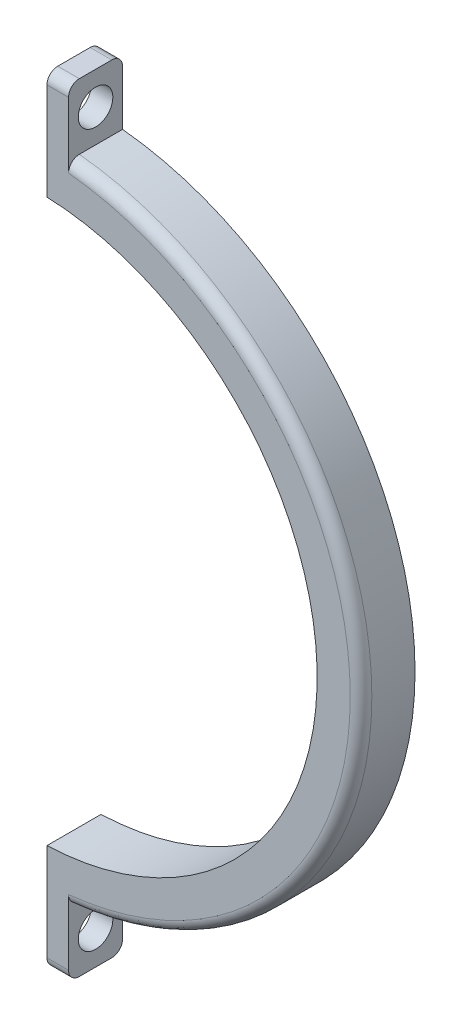
ISO-10303-21;
HEADER;
FILE_DESCRIPTION(('STEP AP214'),'2;1');
FILE_NAME('part.step','',(''),(''),'','','');
FILE_SCHEMA(('AUTOMOTIVE_DESIGN { 1 0 10303 214 1 1 1 1 }'));
ENDSEC;
DATA;
#1=APPLICATION_CONTEXT('core data for automotive mechanical design processes');
#2=APPLICATION_PROTOCOL_DEFINITION('international standard','automotive_design',2000,#1);
#3=PRODUCT_CONTEXT('',#1,'mechanical');
#4=PRODUCT('Part','Part','',(#3));
#5=PRODUCT_RELATED_PRODUCT_CATEGORY('part','',(#4));
#6=PRODUCT_DEFINITION_FORMATION('','',#4);
#7=PRODUCT_DEFINITION_CONTEXT('part definition',#1,'design');
#8=PRODUCT_DEFINITION('design','',#6,#7);
#9=PRODUCT_DEFINITION_SHAPE('','',#8);
#10=(LENGTH_UNIT() NAMED_UNIT(*) SI_UNIT(.MILLI.,.METRE.));
#11=(NAMED_UNIT(*) PLANE_ANGLE_UNIT() SI_UNIT($,.RADIAN.));
#12=(NAMED_UNIT(*) SI_UNIT($,.STERADIAN.) SOLID_ANGLE_UNIT());
#13=UNCERTAINTY_MEASURE_WITH_UNIT(LENGTH_MEASURE(1.E-05),#10,'distance_accuracy_value','');
#14=(GEOMETRIC_REPRESENTATION_CONTEXT(3) GLOBAL_UNCERTAINTY_ASSIGNED_CONTEXT((#13)) GLOBAL_UNIT_ASSIGNED_CONTEXT((#10,
#11,#12)) REPRESENTATION_CONTEXT('',''));
#15=CARTESIAN_POINT('',(0.,0.,0.));
#16=DIRECTION('',(0.,0.,1.));
#17=DIRECTION('',(1.,0.,0.));
#18=AXIS2_PLACEMENT_3D('',#15,#16,#17);
#19=CARTESIAN_POINT('',(0.,36.,1.));
#20=DIRECTION('',(0.,1.,0.));
#21=DIRECTION('',(0.,0.,1.));
#22=AXIS2_PLACEMENT_3D('',#19,#20,#21);
#23=PLANE('',#22);
#24=DIRECTION('',(0.,0.,1.));
#25=VECTOR('',#24,1.);
#26=CARTESIAN_POINT('',(2.,36.,2.5));
#27=LINE('',#26,#25);
#28=CARTESIAN_POINT('',(2.,36.,1.));
#29=VERTEX_POINT('',#28);
#30=CARTESIAN_POINT('',(2.,36.,4.));
#31=VERTEX_POINT('',#30);
#32=EDGE_CURVE('E173',#29,#31,#27,.T.);
#33=ORIENTED_EDGE('',*,*,#32,.F.);
#34=DIRECTION('',(-1.,0.,0.));
#35=VECTOR('',#34,1.);
#36=CARTESIAN_POINT('',(0.,36.,1.));
#37=LINE('',#36,#35);
#38=CARTESIAN_POINT('',(0.,36.,1.));
#39=VERTEX_POINT('',#38);
#40=EDGE_CURVE('E249',#39,#29,#37,.F.);
#41=ORIENTED_EDGE('',*,*,#40,.F.);
#42=DIRECTION('',(0.,0.,-1.));
#43=VECTOR('',#42,1.);
#44=CARTESIAN_POINT('',(0.,36.,2.5));
#45=LINE('',#44,#43);
#46=CARTESIAN_POINT('',(0.,36.,4.));
#47=VERTEX_POINT('',#46);
#48=EDGE_CURVE('E164',#47,#39,#45,.T.);
#49=ORIENTED_EDGE('',*,*,#48,.F.);
#50=DIRECTION('',(1.,0.,0.));
#51=VECTOR('',#50,1.);
#52=CARTESIAN_POINT('',(0.,36.,4.));
#53=LINE('',#52,#51);
#54=EDGE_CURVE('E247',#31,#47,#53,.F.);
#55=ORIENTED_EDGE('',*,*,#54,.F.);
#56=EDGE_LOOP('',(#33,#41,#49,#55));
#57=FACE_BOUND('',#56,.T.);
#58=ADVANCED_FACE('F16',(#57),#23,.T.);
#59=CARTESIAN_POINT('',(0.,32.9666295470958,2.5));
#60=DIRECTION('',(1.,0.,0.));
#61=DIRECTION('',(0.,0.,-1.));
#62=AXIS2_PLACEMENT_3D('',#59,#60,#61);
#63=CYLINDRICAL_SURFACE('',#62,1.6);
#64=CARTESIAN_POINT('',(2.,32.9666295470958,2.5));
#65=DIRECTION('',(1.,0.,0.));
#66=DIRECTION('',(0.,0.,-1.));
#67=AXIS2_PLACEMENT_3D('',#64,#65,#66);
#68=CIRCLE('',#67,1.6);
#69=CARTESIAN_POINT('',(2.,32.9666295470958,0.9));
#70=VERTEX_POINT('',#69);
#71=EDGE_CURVE('E251',#70,#70,#68,.F.);
#72=ORIENTED_EDGE('',*,*,#71,.F.);
#73=EDGE_LOOP('',(#72));
#74=FACE_BOUND('',#73,.T.);
#75=CARTESIAN_POINT('',(0.,32.9666295470958,2.5));
#76=DIRECTION('',(1.,0.,0.));
#77=DIRECTION('',(0.,0.,-1.));
#78=AXIS2_PLACEMENT_3D('',#75,#76,#77);
#79=CIRCLE('',#78,1.6);
#80=CARTESIAN_POINT('',(0.,32.9666295470958,0.9));
#81=VERTEX_POINT('',#80);
#82=EDGE_CURVE('E163',#81,#81,#79,.T.);
#83=ORIENTED_EDGE('',*,*,#82,.F.);
#84=EDGE_LOOP('',(#83));
#85=FACE_BOUND('',#84,.T.);
#86=ADVANCED_FACE('F365',(#74,#85),#63,.F.);
#87=CARTESIAN_POINT('',(0.,35.,4.));
#88=DIRECTION('',(1.,0.,0.));
#89=DIRECTION('',(0.,0.,-1.));
#90=AXIS2_PLACEMENT_3D('',#87,#88,#89);
#91=CYLINDRICAL_SURFACE('',#90,1.);
#92=CARTESIAN_POINT('',(2.,35.,4.));
#93=DIRECTION('',(1.,0.,0.));
#94=DIRECTION('',(0.,0.,-1.));
#95=AXIS2_PLACEMENT_3D('',#92,#93,#94);
#96=CIRCLE('',#95,1.);
#97=CARTESIAN_POINT('',(2.,35.,5.));
#98=VERTEX_POINT('',#97);
#99=EDGE_CURVE('E85',#31,#98,#96,.T.);
#100=ORIENTED_EDGE('',*,*,#99,.F.);
#101=ORIENTED_EDGE('',*,*,#54,.T.);
#102=CARTESIAN_POINT('',(0.,35.,4.));
#103=DIRECTION('',(1.,0.,0.));
#104=DIRECTION('',(0.,0.,-1.));
#105=AXIS2_PLACEMENT_3D('',#102,#103,#104);
#106=CIRCLE('',#105,1.);
#107=CARTESIAN_POINT('',(0.,35.,5.));
#108=VERTEX_POINT('',#107);
#109=EDGE_CURVE('E167',#108,#47,#106,.F.);
#110=ORIENTED_EDGE('',*,*,#109,.F.);
#111=DIRECTION('',(-1.,0.,0.));
#112=VECTOR('',#111,1.);
#113=CARTESIAN_POINT('',(13.0430860613657,35.,5.));
#114=LINE('',#113,#112);
#115=EDGE_CURVE('E252',#98,#108,#114,.T.);
#116=ORIENTED_EDGE('',*,*,#115,.F.);
#117=EDGE_LOOP('',(#100,#101,#110,#116));
#118=FACE_BOUND('',#117,.T.);
#119=ADVANCED_FACE('F361',(#118),#91,.T.);
#120=CARTESIAN_POINT('',(29.0832179129826,0.,4.));
#121=CARTESIAN_POINT('',(29.0832179129826,0.,6.));
#122=CARTESIAN_POINT('',(27.0832179129826,0.,6.));
#123=CARTESIAN_POINT('',(27.0832179129826,0.,4.));
#124=(BOUNDED_CURVE() B_SPLINE_CURVE(3,(#120,#121,#122,#123),.UNSPECIFIED.,.F.,
.F.) B_SPLINE_CURVE_WITH_KNOTS((4,4),(0.,0.5),
.UNSPECIFIED.) CURVE() GEOMETRIC_REPRESENTATION_ITEM() RATIONAL_B_SPLINE_CURVE((1.,
0.333333333333333,0.333333333333333,1.)) REPRESENTATION_ITEM(''));
#125=CARTESIAN_POINT('',(-0.999999999999999,0.,4.));
#126=DIRECTION('',(0.,0.,1.));
#127=AXIS1_PLACEMENT('',#125,#126);
#128=SURFACE_OF_REVOLUTION('',#124,#127);
#129=CARTESIAN_POINT('',(-0.999999999999999,0.,5.));
#130=DIRECTION('',(0.,0.,-1.));
#131=DIRECTION('',(1.,0.,0.));
#132=AXIS2_PLACEMENT_3D('',#129,#130,#131);
#133=CIRCLE('',#132,29.0832179129826);
#134=CARTESIAN_POINT('',(2.,-28.9280757081081,5.));
#135=VERTEX_POINT('',#134);
#136=CARTESIAN_POINT('',(28.0832179129826,0.,5.));
#137=VERTEX_POINT('',#136);
#138=EDGE_CURVE('E246',#135,#137,#133,.F.);
#139=ORIENTED_EDGE('',*,*,#138,.F.);
#140=CARTESIAN_POINT('',(1.99999999999998,-29.9332590941915,4.));
#141=CARTESIAN_POINT('',(1.99999999999999,-29.9332589661824,4.02803183269185));
#142=CARTESIAN_POINT('',(2.,-29.9320737585184,4.05605019102894));
#143=CARTESIAN_POINT('',(2.,-29.9273459549339,4.11188568328244));
#144=CARTESIAN_POINT('',(2.,-29.9238034920647,4.13970282846642));
#145=CARTESIAN_POINT('',(2.,-29.9096760263512,4.22249705120212));
#146=CARTESIAN_POINT('',(2.00000000000001,-29.8955908401553,4.27691834244368));
#147=CARTESIAN_POINT('',(2.00000000000001,-29.8584889872002,4.38262006080036));
#148=CARTESIAN_POINT('',(2.,-29.8354684541231,4.43389911713611));
#149=CARTESIAN_POINT('',(2.,-29.7811632216144,4.53187677663943));
#150=CARTESIAN_POINT('',(2.00000000000001,-29.7498796560895,4.5785760070754));
#151=CARTESIAN_POINT('',(2.00000000000001,-29.6798778782342,4.66618158315184));
#152=CARTESIAN_POINT('',(2.00000000000001,-29.6411432079633,4.70707475025362));
#153=CARTESIAN_POINT('',(1.99999999999999,-29.5573609954424,4.78182812502759));
#154=CARTESIAN_POINT('',(1.99999999999998,-29.5123132914432,4.81568815244545));
#155=CARTESIAN_POINT('',(1.99999999999999,-29.440903741359,4.86055283906325));
#156=CARTESIAN_POINT('',(2.,-29.4163776491829,4.87455477331068));
#157=CARTESIAN_POINT('',(2.,-29.3662620346612,4.90044115369128));
#158=CARTESIAN_POINT('',(2.,-29.3406734824559,4.91232748134967));
#159=CARTESIAN_POINT('',(2.,-29.2625470750562,4.94469431836769));
#160=CARTESIAN_POINT('',(2.,-29.2086027360664,4.96191134786867));
#161=CARTESIAN_POINT('',(2.00000000000001,-29.1166528432015,4.98297816706326));
#162=CARTESIAN_POINT('',(2.,-29.0791972040401,4.98935735370594));
#163=CARTESIAN_POINT('',(2.,-29.003860288784,4.99786667802282));
#164=CARTESIAN_POINT('',(1.99999999999999,-28.9659796937183,5.00000284522244));
#165=CARTESIAN_POINT('',(1.99999999999999,-28.9280757081081,5.));
#166=B_SPLINE_CURVE_WITH_KNOTS('',3,(#140,#141,#142,#143,#144,#145,#146,#147,#148,#149,#150,
#151,#152,#153,#154,#155,#156,#157,#158,#159,#160,#161,#162,#163,#164,#165),.UNSPECIFIED.,.F.,
.F.,(4,2,2,2,2,2,2,2,2,2,2,2,4),(0.,0.0840437049258011,0.168082666546933,0.335860191526751,
0.503710394794133,0.671537576530788,0.839739800789691,1.00794633541942,1.09258364804093,
1.17714530777996,1.34610868702409,1.45987627565296,1.57348207932152),.UNSPECIFIED.);
#167=CARTESIAN_POINT('',(1.99999999999999,-29.9332590941915,4.));
#168=VERTEX_POINT('',#167);
#169=EDGE_CURVE('E175',#168,#135,#166,.T.);
#170=ORIENTED_EDGE('',*,*,#169,.F.);
#171=CARTESIAN_POINT('',(-0.999999999999997,0.,4.));
#172=DIRECTION('',(0.,0.,-1.));
#173=DIRECTION('',(-1.,0.,0.));
#174=AXIS2_PLACEMENT_3D('',#171,#172,#173);
#175=CIRCLE('',#174,30.0832179129826);
#176=CARTESIAN_POINT('',(2.,29.9332590941915,4.));
#177=VERTEX_POINT('',#176);
#178=EDGE_CURVE('E179',#177,#168,#175,.T.);
#179=ORIENTED_EDGE('',*,*,#178,.F.);
#180=CARTESIAN_POINT('',(2.,28.9280757081081,5.));
#181=CARTESIAN_POINT('',(2.,28.9564654745857,4.99999971763141));
#182=CARTESIAN_POINT('',(2.,28.9848416839974,4.9988031447003));
#183=CARTESIAN_POINT('',(2.,29.0413920253424,4.99402874132168));
#184=CARTESIAN_POINT('',(2.,29.0695661642327,4.99045099325509));
#185=CARTESIAN_POINT('',(2.,29.153442395582,4.97617707386501));
#186=CARTESIAN_POINT('',(1.99999999999999,29.2085841485179,4.96194014852983));
#187=CARTESIAN_POINT('',(1.99999999999999,29.3156951400941,4.92440587265042));
#188=CARTESIAN_POINT('',(2.,29.36766264905,4.9011036323761));
#189=CARTESIAN_POINT('',(2.,29.4669318603245,4.84608498402124));
#190=CARTESIAN_POINT('',(2.,29.5142345987746,4.81437045026687));
#191=CARTESIAN_POINT('',(2.,29.6026991589646,4.74350778100956));
#192=CARTESIAN_POINT('',(2.,29.6438755337486,4.70437778083796));
#193=CARTESIAN_POINT('',(2.,29.7190462831808,4.61970438955179));
#194=CARTESIAN_POINT('',(2.,29.7530410836587,4.57416137896219));
#195=CARTESIAN_POINT('',(2.,29.79780393353,4.50217955309637));
#196=CARTESIAN_POINT('',(2.,29.8116689926746,4.47761766634511));
#197=CARTESIAN_POINT('',(2.,29.8372629704534,4.42743451754058));
#198=CARTESIAN_POINT('',(2.,29.8489937695365,4.40181421270226));
#199=CARTESIAN_POINT('',(2.,29.8808549904111,4.32360665407879));
#200=CARTESIAN_POINT('',(1.99999999999998,29.8976876812935,4.26961888918407));
#201=CARTESIAN_POINT('',(1.99999999999998,29.9176210279945,4.17940388514848));
#202=CARTESIAN_POINT('',(1.99999999999999,29.9234815411749,4.14375189024134));
#203=CARTESIAN_POINT('',(2.00000000000001,29.9312988208954,4.07207399805051));
#204=CARTESIAN_POINT('',(2.00000000000001,29.933261148039,4.03604870715611));
#205=CARTESIAN_POINT('',(2.,29.9332590941915,4.));
#206=B_SPLINE_CURVE_WITH_KNOTS('',3,(#180,#181,#182,#183,#184,#185,#186,#187,#188,#189,#190,
#191,#192,#193,#194,#195,#196,#197,#198,#199,#200,#201,#202,#203,#204,#205),.UNSPECIFIED.,.F.,
.F.,(4,2,2,2,2,2,2,2,2,2,2,2,4),(0.,0.0851171284531173,0.170231312283935,0.340205411605452,
0.510271320467366,0.680299369069249,0.849916839896694,1.01952425047132,1.10405113039033,
1.18850317103927,1.35721939918158,1.46542056154832,1.57346726821852),.UNSPECIFIED.);
#207=CARTESIAN_POINT('',(1.99999999999999,28.9280757081081,5.));
#208=VERTEX_POINT('',#207);
#209=EDGE_CURVE('E279',#208,#177,#206,.T.);
#210=ORIENTED_EDGE('',*,*,#209,.F.);
#211=CARTESIAN_POINT('',(-0.999999999999999,0.,5.));
#212=DIRECTION('',(0.,0.,-1.));
#213=DIRECTION('',(0.103152271835119,0.994665576369894,0.));
#214=AXIS2_PLACEMENT_3D('',#211,#212,#213);
#215=CIRCLE('',#214,29.0832179129826);
#216=EDGE_CURVE('E93',#137,#208,#215,.F.);
#217=ORIENTED_EDGE('',*,*,#216,.F.);
#218=EDGE_LOOP('',(#139,#170,#179,#210,#217));
#219=FACE_BOUND('',#218,.T.);
#220=ADVANCED_FACE('F18',(#219),#128,.T.);
#221=CARTESIAN_POINT('',(2.,28.9280757081081,5.));
#222=DIRECTION('',(1.,0.,0.));
#223=DIRECTION('',(0.,0.,-1.));
#224=AXIS2_PLACEMENT_3D('',#221,#222,#223);
#225=PLANE('',#224);
#226=ORIENTED_EDGE('',*,*,#71,.T.);
#227=EDGE_LOOP('',(#226));
#228=FACE_BOUND('',#227,.T.);
#229=DIRECTION('',(0.,1.,0.));
#230=VECTOR('',#229,1.);
#231=CARTESIAN_POINT('',(2.,0.,0.));
#232=LINE('',#231,#230);
#233=CARTESIAN_POINT('',(2.,29.9332590941915,0.));
#234=VERTEX_POINT('',#233);
#235=CARTESIAN_POINT('',(2.,35.,0.));
#236=VERTEX_POINT('',#235);
#237=EDGE_CURVE('E172',#234,#236,#232,.T.);
#238=ORIENTED_EDGE('',*,*,#237,.T.);
#239=CARTESIAN_POINT('',(2.,35.,1.));
#240=DIRECTION('',(-1.,0.,0.));
#241=DIRECTION('',(0.,0.,1.));
#242=AXIS2_PLACEMENT_3D('',#239,#240,#241);
#243=CIRCLE('',#242,1.);
#244=EDGE_CURVE('E250',#29,#236,#243,.T.);
#245=ORIENTED_EDGE('',*,*,#244,.F.);
#246=ORIENTED_EDGE('',*,*,#32,.T.);
#247=ORIENTED_EDGE('',*,*,#99,.T.);
#248=DIRECTION('',(0.,1.,0.));
#249=VECTOR('',#248,1.);
#250=CARTESIAN_POINT('',(2.,0.,5.));
#251=LINE('',#250,#249);
#252=EDGE_CURVE('E254',#208,#98,#251,.T.);
#253=ORIENTED_EDGE('',*,*,#252,.F.);
#254=ORIENTED_EDGE('',*,*,#209,.T.);
#255=DIRECTION('',(0.,0.,-1.));
#256=VECTOR('',#255,1.);
#257=CARTESIAN_POINT('',(2.,29.9332590941915,5.));
#258=LINE('',#257,#256);
#259=EDGE_CURVE('E176',#234,#177,#258,.F.);
#260=ORIENTED_EDGE('',*,*,#259,.F.);
#261=EDGE_LOOP('',(#238,#245,#246,#247,#253,#254,#260));
#262=FACE_BOUND('',#261,.T.);
#263=ADVANCED_FACE('F288',(#228,#262),#225,.T.);
#264=CARTESIAN_POINT('',(2.,35.,1.));
#265=DIRECTION('',(-1.,0.,0.));
#266=DIRECTION('',(0.,0.,1.));
#267=AXIS2_PLACEMENT_3D('',#264,#265,#266);
#268=CYLINDRICAL_SURFACE('',#267,1.);
#269=ORIENTED_EDGE('',*,*,#244,.T.);
#270=DIRECTION('',(-1.,0.,0.));
#271=VECTOR('',#270,1.);
#272=CARTESIAN_POINT('',(13.9964638012394,35.,0.));
#273=LINE('',#272,#271);
#274=CARTESIAN_POINT('',(0.,35.,0.));
#275=VERTEX_POINT('',#274);
#276=EDGE_CURVE('E168',#236,#275,#273,.T.);
#277=ORIENTED_EDGE('',*,*,#276,.T.);
#278=CARTESIAN_POINT('',(0.,35.,1.));
#279=DIRECTION('',(-1.,0.,0.));
#280=DIRECTION('',(0.,0.,1.));
#281=AXIS2_PLACEMENT_3D('',#278,#279,#280);
#282=CIRCLE('',#281,1.);
#283=EDGE_CURVE('E166',#39,#275,#282,.T.);
#284=ORIENTED_EDGE('',*,*,#283,.F.);
#285=ORIENTED_EDGE('',*,*,#40,.T.);
#286=EDGE_LOOP('',(#269,#277,#284,#285));
#287=FACE_BOUND('',#286,.T.);
#288=ADVANCED_FACE('F196',(#287),#268,.T.);
#289=CARTESIAN_POINT('',(0.,36.,0.));
#290=DIRECTION('',(-1.,0.,0.));
#291=DIRECTION('',(0.,-1.,0.));
#292=AXIS2_PLACEMENT_3D('',#289,#290,#291);
#293=PLANE('',#292);
#294=ORIENTED_EDGE('',*,*,#82,.T.);
#295=EDGE_LOOP('',(#294));
#296=FACE_BOUND('',#295,.T.);
#297=DIRECTION('',(0.,-1.,0.));
#298=VECTOR('',#297,1.);
#299=CARTESIAN_POINT('',(0.,0.,0.));
#300=LINE('',#299,#298);
#301=CARTESIAN_POINT('',(0.,26.,0.));
#302=VERTEX_POINT('',#301);
#303=EDGE_CURVE('E171',#275,#302,#300,.T.);
#304=ORIENTED_EDGE('',*,*,#303,.T.);
#305=DIRECTION('',(0.,0.,-1.));
#306=VECTOR('',#305,1.);
#307=CARTESIAN_POINT('',(0.,26.,5.));
#308=LINE('',#307,#306);
#309=CARTESIAN_POINT('',(0.,26.,5.));
#310=VERTEX_POINT('',#309);
#311=EDGE_CURVE('E159',#302,#310,#308,.F.);
#312=ORIENTED_EDGE('',*,*,#311,.T.);
#313=DIRECTION('',(0.,-1.,0.));
#314=VECTOR('',#313,1.);
#315=CARTESIAN_POINT('',(0.,0.,5.));
#316=LINE('',#315,#314);
#317=EDGE_CURVE('E253',#108,#310,#316,.T.);
#318=ORIENTED_EDGE('',*,*,#317,.F.);
#319=ORIENTED_EDGE('',*,*,#109,.T.);
#320=ORIENTED_EDGE('',*,*,#48,.T.);
#321=ORIENTED_EDGE('',*,*,#283,.T.);
#322=EDGE_LOOP('',(#304,#312,#318,#319,#320,#321));
#323=FACE_BOUND('',#322,.T.);
#324=ADVANCED_FACE('F294',(#296,#323),#293,.T.);
#325=CARTESIAN_POINT('',(-0.999999999999997,0.,5.));
#326=DIRECTION('',(0.,0.,-1.));
#327=DIRECTION('',(-1.,0.,0.));
#328=AXIS2_PLACEMENT_3D('',#325,#326,#327);
#329=CYLINDRICAL_SURFACE('',#328,26.0192236625154);
#330=DIRECTION('',(0.,0.,1.));
#331=VECTOR('',#330,1.);
#332=CARTESIAN_POINT('',(0.,-26.,2.5));
#333=LINE('',#332,#331);
#334=CARTESIAN_POINT('',(0.,-26.,0.));
#335=VERTEX_POINT('',#334);
#336=CARTESIAN_POINT('',(0.,-26.,5.));
#337=VERTEX_POINT('',#336);
#338=EDGE_CURVE('E145',#335,#337,#333,.T.);
#339=ORIENTED_EDGE('',*,*,#338,.T.);
#340=CARTESIAN_POINT('',(-0.999999999999997,0.,5.));
#341=DIRECTION('',(0.,0.,-1.));
#342=DIRECTION('',(-1.,0.,0.));
#343=AXIS2_PLACEMENT_3D('',#340,#341,#342);
#344=CIRCLE('',#343,26.0192236625154);
#345=EDGE_CURVE('E180',#310,#337,#344,.T.);
#346=ORIENTED_EDGE('',*,*,#345,.F.);
#347=ORIENTED_EDGE('',*,*,#311,.F.);
#348=CARTESIAN_POINT('',(-0.999999999999997,0.,0.));
#349=DIRECTION('',(0.,0.,-1.));
#350=DIRECTION('',(-1.,0.,0.));
#351=AXIS2_PLACEMENT_3D('',#348,#349,#350);
#352=CIRCLE('',#351,26.0192236625154);
#353=EDGE_CURVE('E314',#302,#335,#352,.T.);
#354=ORIENTED_EDGE('',*,*,#353,.T.);
#355=EDGE_LOOP('',(#339,#346,#347,#354));
#356=FACE_BOUND('',#355,.T.);
#357=ADVANCED_FACE('F296',(#356),#329,.F.);
#358=CARTESIAN_POINT('',(2.,-35.,4.));
#359=DIRECTION('',(-1.,0.,0.));
#360=DIRECTION('',(0.,0.,1.));
#361=AXIS2_PLACEMENT_3D('',#358,#359,#360);
#362=CYLINDRICAL_SURFACE('',#361,1.);
#363=CARTESIAN_POINT('',(2.,-35.,4.));
#364=DIRECTION('',(-1.,0.,0.));
#365=DIRECTION('',(0.,0.,1.));
#366=AXIS2_PLACEMENT_3D('',#363,#364,#365);
#367=CIRCLE('',#366,1.);
#368=CARTESIAN_POINT('',(2.,-36.,4.));
#369=VERTEX_POINT('',#368);
#370=CARTESIAN_POINT('',(2.,-35.,5.));
#371=VERTEX_POINT('',#370);
#372=EDGE_CURVE('E162',#369,#371,#367,.T.);
#373=ORIENTED_EDGE('',*,*,#372,.T.);
#374=DIRECTION('',(1.,0.,0.));
#375=VECTOR('',#374,1.);
#376=CARTESIAN_POINT('',(13.0430860613657,-35.,5.));
#377=LINE('',#376,#375);
#378=CARTESIAN_POINT('',(0.,-35.,5.));
#379=VERTEX_POINT('',#378);
#380=EDGE_CURVE('E140',#379,#371,#377,.T.);
#381=ORIENTED_EDGE('',*,*,#380,.F.);
#382=CARTESIAN_POINT('',(0.,-35.,4.));
#383=DIRECTION('',(-1.,0.,0.));
#384=DIRECTION('',(0.,0.,1.));
#385=AXIS2_PLACEMENT_3D('',#382,#383,#384);
#386=CIRCLE('',#385,1.);
#387=CARTESIAN_POINT('',(0.,-36.,4.));
#388=VERTEX_POINT('',#387);
#389=EDGE_CURVE('E137',#379,#388,#386,.F.);
#390=ORIENTED_EDGE('',*,*,#389,.T.);
#391=DIRECTION('',(1.,0.,0.));
#392=VECTOR('',#391,1.);
#393=CARTESIAN_POINT('',(1.,-36.,4.));
#394=LINE('',#393,#392);
#395=EDGE_CURVE('E126',#388,#369,#394,.T.);
#396=ORIENTED_EDGE('',*,*,#395,.T.);
#397=EDGE_LOOP('',(#373,#381,#390,#396));
#398=FACE_BOUND('',#397,.T.);
#399=ADVANCED_FACE('F138',(#398),#362,.T.);
#400=CARTESIAN_POINT('',(0.,-35.,1.));
#401=DIRECTION('',(1.,0.,0.));
#402=DIRECTION('',(0.,0.,-1.));
#403=AXIS2_PLACEMENT_3D('',#400,#401,#402);
#404=CYLINDRICAL_SURFACE('',#403,1.);
#405=CARTESIAN_POINT('',(2.,-35.,1.));
#406=DIRECTION('',(1.,0.,0.));
#407=DIRECTION('',(0.,0.,-1.));
#408=AXIS2_PLACEMENT_3D('',#405,#406,#407);
#409=CIRCLE('',#408,1.);
#410=CARTESIAN_POINT('',(2.,-35.,0.));
#411=VERTEX_POINT('',#410);
#412=CARTESIAN_POINT('',(2.,-36.,1.));
#413=VERTEX_POINT('',#412);
#414=EDGE_CURVE('E38',#411,#413,#409,.F.);
#415=ORIENTED_EDGE('',*,*,#414,.T.);
#416=DIRECTION('',(-1.,0.,0.));
#417=VECTOR('',#416,1.);
#418=CARTESIAN_POINT('',(1.,-36.,1.));
#419=LINE('',#418,#417);
#420=CARTESIAN_POINT('',(0.,-36.,1.));
#421=VERTEX_POINT('',#420);
#422=EDGE_CURVE('E133',#413,#421,#419,.T.);
#423=ORIENTED_EDGE('',*,*,#422,.T.);
#424=CARTESIAN_POINT('',(0.,-35.,1.));
#425=DIRECTION('',(1.,0.,0.));
#426=DIRECTION('',(0.,0.,-1.));
#427=AXIS2_PLACEMENT_3D('',#424,#425,#426);
#428=CIRCLE('',#427,1.);
#429=CARTESIAN_POINT('',(0.,-35.,0.));
#430=VERTEX_POINT('',#429);
#431=EDGE_CURVE('E144',#421,#430,#428,.T.);
#432=ORIENTED_EDGE('',*,*,#431,.T.);
#433=DIRECTION('',(1.,0.,0.));
#434=VECTOR('',#433,1.);
#435=CARTESIAN_POINT('',(13.9964638012394,-35.,0.));
#436=LINE('',#435,#434);
#437=EDGE_CURVE('E134',#430,#411,#436,.T.);
#438=ORIENTED_EDGE('',*,*,#437,.T.);
#439=EDGE_LOOP('',(#415,#423,#432,#438));
#440=FACE_BOUND('',#439,.T.);
#441=ADVANCED_FACE('F425',(#440),#404,.T.);
#442=CARTESIAN_POINT('',(0.,-36.,5.));
#443=DIRECTION('',(1.,0.,0.));
#444=DIRECTION('',(0.,0.,-1.));
#445=AXIS2_PLACEMENT_3D('',#442,#443,#444);
#446=PLANE('',#445);
#447=CARTESIAN_POINT('',(0.,-32.9666295470958,2.5));
#448=DIRECTION('',(1.,0.,0.));
#449=DIRECTION('',(0.,0.,-1.));
#450=AXIS2_PLACEMENT_3D('',#447,#448,#449);
#451=CIRCLE('',#450,1.6);
#452=CARTESIAN_POINT('',(0.,-32.9666295470958,0.9));
#453=VERTEX_POINT('',#452);
#454=EDGE_CURVE('E149',#453,#453,#451,.T.);
#455=ORIENTED_EDGE('',*,*,#454,.T.);
#456=EDGE_LOOP('',(#455));
#457=FACE_BOUND('',#456,.T.);
#458=ORIENTED_EDGE('',*,*,#431,.F.);
#459=DIRECTION('',(0.,0.,1.));
#460=VECTOR('',#459,1.);
#461=CARTESIAN_POINT('',(0.,-36.,2.5));
#462=LINE('',#461,#460);
#463=EDGE_CURVE('E130',#421,#388,#462,.T.);
#464=ORIENTED_EDGE('',*,*,#463,.T.);
#465=ORIENTED_EDGE('',*,*,#389,.F.);
#466=DIRECTION('',(0.,-1.,0.));
#467=VECTOR('',#466,1.);
#468=CARTESIAN_POINT('',(0.,0.,5.));
#469=LINE('',#468,#467);
#470=EDGE_CURVE('E262',#337,#379,#469,.T.);
#471=ORIENTED_EDGE('',*,*,#470,.F.);
#472=ORIENTED_EDGE('',*,*,#338,.F.);
#473=DIRECTION('',(0.,-1.,0.));
#474=VECTOR('',#473,1.);
#475=CARTESIAN_POINT('',(0.,0.,0.));
#476=LINE('',#475,#474);
#477=EDGE_CURVE('E317',#335,#430,#476,.T.);
#478=ORIENTED_EDGE('',*,*,#477,.T.);
#479=EDGE_LOOP('',(#458,#464,#465,#471,#472,#478));
#480=FACE_BOUND('',#479,.T.);
#481=ADVANCED_FACE('F147',(#457,#480),#446,.F.);
#482=CARTESIAN_POINT('',(-1.99704579025111,-35.,5.));
#483=DIRECTION('',(0.,0.,1.));
#484=DIRECTION('',(1.,0.,0.));
#485=AXIS2_PLACEMENT_3D('',#482,#483,#484);
#486=PLANE('',#485);
#487=ORIENTED_EDGE('',*,*,#317,.T.);
#488=ORIENTED_EDGE('',*,*,#345,.T.);
#489=ORIENTED_EDGE('',*,*,#470,.T.);
#490=ORIENTED_EDGE('',*,*,#380,.T.);
#491=DIRECTION('',(0.,1.,0.));
#492=VECTOR('',#491,1.);
#493=CARTESIAN_POINT('',(2.,-32.464037854054,5.));
#494=LINE('',#493,#492);
#495=EDGE_CURVE('E152',#371,#135,#494,.T.);
#496=ORIENTED_EDGE('',*,*,#495,.T.);
#497=ORIENTED_EDGE('',*,*,#138,.T.);
#498=ORIENTED_EDGE('',*,*,#216,.T.);
#499=ORIENTED_EDGE('',*,*,#252,.T.);
#500=ORIENTED_EDGE('',*,*,#115,.T.);
#501=EDGE_LOOP('',(#487,#488,#489,#490,#496,#497,#498,#499,#500));
#502=FACE_BOUND('',#501,.T.);
#503=ADVANCED_FACE('F225',(#502),#486,.T.);
#504=CARTESIAN_POINT('',(-0.999999999999997,0.,4.));
#505=DIRECTION('',(0.,0.,-1.));
#506=DIRECTION('',(-1.,0.,0.));
#507=AXIS2_PLACEMENT_3D('',#504,#505,#506);
#508=CYLINDRICAL_SURFACE('',#507,30.0832179129826);
#509=DIRECTION('',(0.,0.,-1.));
#510=VECTOR('',#509,1.);
#511=CARTESIAN_POINT('',(2.,-29.9332590941915,2.5));
#512=LINE('',#511,#510);
#513=CARTESIAN_POINT('',(2.,-29.9332590941915,0.));
#514=VERTEX_POINT('',#513);
#515=EDGE_CURVE('E338',#168,#514,#512,.T.);
#516=ORIENTED_EDGE('',*,*,#515,.T.);
#517=CARTESIAN_POINT('',(-0.999999999999997,0.,0.));
#518=DIRECTION('',(0.,0.,-1.));
#519=DIRECTION('',(-1.,0.,0.));
#520=AXIS2_PLACEMENT_3D('',#517,#518,#519);
#521=CIRCLE('',#520,30.0832179129826);
#522=EDGE_CURVE('E322',#514,#234,#521,.F.);
#523=ORIENTED_EDGE('',*,*,#522,.T.);
#524=ORIENTED_EDGE('',*,*,#259,.T.);
#525=ORIENTED_EDGE('',*,*,#178,.T.);
#526=EDGE_LOOP('',(#516,#523,#524,#525));
#527=FACE_BOUND('',#526,.T.);
#528=ADVANCED_FACE('F223',(#527),#508,.T.);
#529=CARTESIAN_POINT('',(-3.9403314917127,-35.,0.));
#530=DIRECTION('',(0.,0.,1.));
#531=DIRECTION('',(1.,0.,0.));
#532=AXIS2_PLACEMENT_3D('',#529,#530,#531);
#533=PLANE('',#532);
#534=ORIENTED_EDGE('',*,*,#437,.F.);
#535=ORIENTED_EDGE('',*,*,#477,.F.);
#536=ORIENTED_EDGE('',*,*,#353,.F.);
#537=ORIENTED_EDGE('',*,*,#303,.F.);
#538=ORIENTED_EDGE('',*,*,#276,.F.);
#539=ORIENTED_EDGE('',*,*,#237,.F.);
#540=ORIENTED_EDGE('',*,*,#522,.F.);
#541=DIRECTION('',(0.,-1.,0.));
#542=VECTOR('',#541,1.);
#543=CARTESIAN_POINT('',(2.,-32.464037854054,0.));
#544=LINE('',#543,#542);
#545=EDGE_CURVE('E341',#514,#411,#544,.T.);
#546=ORIENTED_EDGE('',*,*,#545,.T.);
#547=EDGE_LOOP('',(#534,#535,#536,#537,#538,#539,#540,#546));
#548=FACE_BOUND('',#547,.T.);
#549=ADVANCED_FACE('F220',(#548),#533,.F.);
#550=CARTESIAN_POINT('',(0.,-36.,1.));
#551=DIRECTION('',(0.,1.,0.));
#552=DIRECTION('',(0.,0.,1.));
#553=AXIS2_PLACEMENT_3D('',#550,#551,#552);
#554=PLANE('',#553);
#555=ORIENTED_EDGE('',*,*,#422,.F.);
#556=DIRECTION('',(0.,0.,1.));
#557=VECTOR('',#556,1.);
#558=CARTESIAN_POINT('',(2.,-36.,2.5));
#559=LINE('',#558,#557);
#560=EDGE_CURVE('E29',#413,#369,#559,.T.);
#561=ORIENTED_EDGE('',*,*,#560,.T.);
#562=ORIENTED_EDGE('',*,*,#395,.F.);
#563=ORIENTED_EDGE('',*,*,#463,.F.);
#564=EDGE_LOOP('',(#555,#561,#562,#563));
#565=FACE_BOUND('',#564,.T.);
#566=ADVANCED_FACE('F128',(#565),#554,.F.);
#567=CARTESIAN_POINT('',(0.,-32.9666295470958,2.5));
#568=DIRECTION('',(1.,0.,0.));
#569=DIRECTION('',(0.,0.,-1.));
#570=AXIS2_PLACEMENT_3D('',#567,#568,#569);
#571=CYLINDRICAL_SURFACE('',#570,1.6);
#572=ORIENTED_EDGE('',*,*,#454,.F.);
#573=EDGE_LOOP('',(#572));
#574=FACE_BOUND('',#573,.T.);
#575=CARTESIAN_POINT('',(2.,-32.9666295470958,2.5));
#576=DIRECTION('',(1.,0.,0.));
#577=DIRECTION('',(0.,0.,-1.));
#578=AXIS2_PLACEMENT_3D('',#575,#576,#577);
#579=CIRCLE('',#578,1.6);
#580=CARTESIAN_POINT('',(2.,-32.9666295470958,0.9));
#581=VERTEX_POINT('',#580);
#582=EDGE_CURVE('E11',#581,#581,#579,.T.);
#583=ORIENTED_EDGE('',*,*,#582,.T.);
#584=EDGE_LOOP('',(#583));
#585=FACE_BOUND('',#584,.T.);
#586=ADVANCED_FACE('F216',(#574,#585),#571,.F.);
#587=CARTESIAN_POINT('',(2.,-36.,0.));
#588=DIRECTION('',(-1.,0.,0.));
#589=DIRECTION('',(0.,0.,1.));
#590=AXIS2_PLACEMENT_3D('',#587,#588,#589);
#591=PLANE('',#590);
#592=ORIENTED_EDGE('',*,*,#582,.F.);
#593=EDGE_LOOP('',(#592));
#594=FACE_BOUND('',#593,.T.);
#595=ORIENTED_EDGE('',*,*,#414,.F.);
#596=ORIENTED_EDGE('',*,*,#545,.F.);
#597=ORIENTED_EDGE('',*,*,#515,.F.);
#598=ORIENTED_EDGE('',*,*,#169,.T.);
#599=ORIENTED_EDGE('',*,*,#495,.F.);
#600=ORIENTED_EDGE('',*,*,#372,.F.);
#601=ORIENTED_EDGE('',*,*,#560,.F.);
#602=EDGE_LOOP('',(#595,#596,#597,#598,#599,#600,#601));
#603=FACE_BOUND('',#602,.T.);
#604=ADVANCED_FACE('F212',(#594,#603),#591,.F.);
#605=CLOSED_SHELL('',(#58,#86,#119,#220,#263,#288,#324,#357,#399,#441,#481,#503,#528,#549,#566,
#586,#604));
#606=MANIFOLD_SOLID_BREP('B1',#605);
#607=ADVANCED_BREP_SHAPE_REPRESENTATION('',(#18,#606),#14);
#608=SHAPE_DEFINITION_REPRESENTATION(#9,#607);
ENDSEC;
END-ISO-10303-21;
